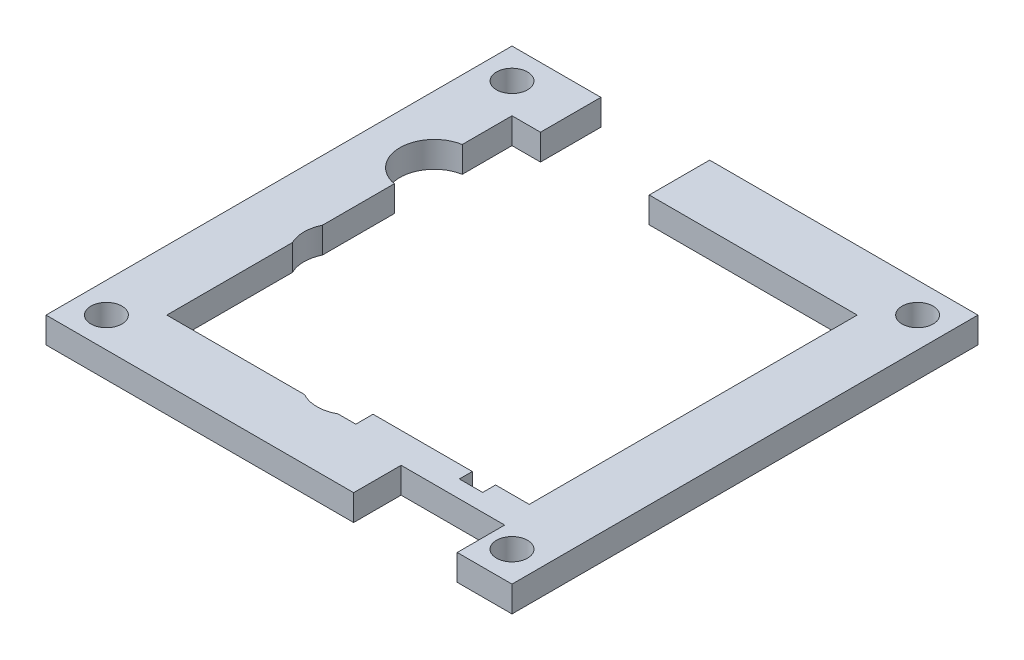
ISO-10303-21;
HEADER;
FILE_DESCRIPTION(('STEP AP214'),'2;1');
FILE_NAME('part.step','',(''),(''),'','','');
FILE_SCHEMA(('AUTOMOTIVE_DESIGN { 1 0 10303 214 1 1 1 1 }'));
ENDSEC;
DATA;
#1=APPLICATION_CONTEXT('core data for automotive mechanical design processes');
#2=APPLICATION_PROTOCOL_DEFINITION('international standard','automotive_design',2000,#1);
#3=PRODUCT_CONTEXT('',#1,'mechanical');
#4=PRODUCT('Part','Part','',(#3));
#5=PRODUCT_RELATED_PRODUCT_CATEGORY('part','',(#4));
#6=PRODUCT_DEFINITION_FORMATION('','',#4);
#7=PRODUCT_DEFINITION_CONTEXT('part definition',#1,'design');
#8=PRODUCT_DEFINITION('design','',#6,#7);
#9=PRODUCT_DEFINITION_SHAPE('','',#8);
#10=(LENGTH_UNIT() NAMED_UNIT(*) SI_UNIT(.MILLI.,.METRE.));
#11=(NAMED_UNIT(*) PLANE_ANGLE_UNIT() SI_UNIT($,.RADIAN.));
#12=(NAMED_UNIT(*) SI_UNIT($,.STERADIAN.) SOLID_ANGLE_UNIT());
#13=UNCERTAINTY_MEASURE_WITH_UNIT(LENGTH_MEASURE(1.E-05),#10,'distance_accuracy_value','');
#14=(GEOMETRIC_REPRESENTATION_CONTEXT(3) GLOBAL_UNCERTAINTY_ASSIGNED_CONTEXT((#13)) GLOBAL_UNIT_ASSIGNED_CONTEXT((#10,
#11,#12)) REPRESENTATION_CONTEXT('',''));
#15=CARTESIAN_POINT('',(0.,0.,0.));
#16=DIRECTION('',(0.,0.,1.));
#17=DIRECTION('',(1.,0.,0.));
#18=AXIS2_PLACEMENT_3D('',#15,#16,#17);
#19=CARTESIAN_POINT('',(20.,3.,0.));
#20=DIRECTION('',(-1.,0.,0.));
#21=DIRECTION('',(0.,0.,1.));
#22=AXIS2_PLACEMENT_3D('',#19,#20,#21);
#23=PLANE('',#22);
#24=DIRECTION('',(0.,0.,-1.));
#25=VECTOR('',#24,1.);
#26=CARTESIAN_POINT('',(20.,0.,0.));
#27=LINE('',#26,#25);
#28=CARTESIAN_POINT('',(20.,0.,18.));
#29=VERTEX_POINT('',#28);
#30=CARTESIAN_POINT('',(20.,0.,-20.));
#31=VERTEX_POINT('',#30);
#32=EDGE_CURVE('E261',#29,#31,#27,.T.);
#33=ORIENTED_EDGE('',*,*,#32,.F.);
#34=DIRECTION('',(0.,-1.,0.));
#35=VECTOR('',#34,1.);
#36=CARTESIAN_POINT('',(20.,3.,18.));
#37=LINE('',#36,#35);
#38=CARTESIAN_POINT('',(20.,3.,18.));
#39=VERTEX_POINT('',#38);
#40=EDGE_CURVE('E11',#39,#29,#37,.T.);
#41=ORIENTED_EDGE('',*,*,#40,.F.);
#42=DIRECTION('',(0.,0.,-1.));
#43=VECTOR('',#42,1.);
#44=CARTESIAN_POINT('',(20.,3.,0.));
#45=LINE('',#44,#43);
#46=CARTESIAN_POINT('',(20.,3.,-20.));
#47=VERTEX_POINT('',#46);
#48=EDGE_CURVE('E339',#39,#47,#45,.T.);
#49=ORIENTED_EDGE('',*,*,#48,.T.);
#50=DIRECTION('',(0.,-1.,0.));
#51=VECTOR('',#50,1.);
#52=CARTESIAN_POINT('',(20.,3.,-20.));
#53=LINE('',#52,#51);
#54=EDGE_CURVE('E145',#47,#31,#53,.T.);
#55=ORIENTED_EDGE('',*,*,#54,.T.);
#56=EDGE_LOOP('',(#33,#41,#49,#55));
#57=FACE_BOUND('',#56,.T.);
#58=ADVANCED_FACE('F35',(#57),#23,.T.);
#59=CARTESIAN_POINT('',(0.,3.,18.));
#60=DIRECTION('',(0.,0.,-1.));
#61=DIRECTION('',(-1.,0.,0.));
#62=AXIS2_PLACEMENT_3D('',#59,#60,#61);
#63=PLANE('',#62);
#64=DIRECTION('',(1.,0.,0.));
#65=VECTOR('',#64,1.);
#66=CARTESIAN_POINT('',(0.,0.,18.));
#67=LINE('',#66,#65);
#68=CARTESIAN_POINT('',(16.1,0.,18.));
#69=VERTEX_POINT('',#68);
#70=EDGE_CURVE('E264',#69,#29,#67,.T.);
#71=ORIENTED_EDGE('',*,*,#70,.F.);
#72=DIRECTION('',(0.,-1.,0.));
#73=VECTOR('',#72,1.);
#74=CARTESIAN_POINT('',(16.1,3.,18.));
#75=LINE('',#74,#73);
#76=CARTESIAN_POINT('',(16.1,3.,18.));
#77=VERTEX_POINT('',#76);
#78=EDGE_CURVE('E43',#77,#69,#75,.T.);
#79=ORIENTED_EDGE('',*,*,#78,.F.);
#80=DIRECTION('',(1.,0.,0.));
#81=VECTOR('',#80,1.);
#82=CARTESIAN_POINT('',(0.,3.,18.));
#83=LINE('',#82,#81);
#84=EDGE_CURVE('E408',#77,#39,#83,.T.);
#85=ORIENTED_EDGE('',*,*,#84,.T.);
#86=ORIENTED_EDGE('',*,*,#40,.T.);
#87=EDGE_LOOP('',(#71,#79,#85,#86));
#88=FACE_BOUND('',#87,.T.);
#89=ADVANCED_FACE('F407',(#88),#63,.T.);
#90=CARTESIAN_POINT('',(16.1,3.,0.));
#91=DIRECTION('',(1.,0.,0.));
#92=DIRECTION('',(0.,0.,-1.));
#93=AXIS2_PLACEMENT_3D('',#90,#91,#92);
#94=PLANE('',#93);
#95=DIRECTION('',(0.,0.,1.));
#96=VECTOR('',#95,1.);
#97=CARTESIAN_POINT('',(16.1,0.,0.));
#98=LINE('',#97,#96);
#99=CARTESIAN_POINT('',(16.1,0.,19.5));
#100=VERTEX_POINT('',#99);
#101=EDGE_CURVE('E267',#69,#100,#98,.T.);
#102=ORIENTED_EDGE('',*,*,#101,.T.);
#103=DIRECTION('',(0.,-1.,0.));
#104=VECTOR('',#103,1.);
#105=CARTESIAN_POINT('',(16.1,3.,19.5));
#106=LINE('',#105,#104);
#107=CARTESIAN_POINT('',(16.1,3.,19.5));
#108=VERTEX_POINT('',#107);
#109=EDGE_CURVE('E392',#108,#100,#106,.T.);
#110=ORIENTED_EDGE('',*,*,#109,.F.);
#111=DIRECTION('',(0.,0.,1.));
#112=VECTOR('',#111,1.);
#113=CARTESIAN_POINT('',(16.1,3.,0.));
#114=LINE('',#113,#112);
#115=EDGE_CURVE('E398',#77,#108,#114,.T.);
#116=ORIENTED_EDGE('',*,*,#115,.F.);
#117=ORIENTED_EDGE('',*,*,#78,.T.);
#118=EDGE_LOOP('',(#102,#110,#116,#117));
#119=FACE_BOUND('',#118,.T.);
#120=ADVANCED_FACE('F396',(#119),#94,.F.);
#121=CARTESIAN_POINT('',(0.,3.,19.5));
#122=DIRECTION('',(0.,0.,-1.));
#123=DIRECTION('',(-1.,0.,0.));
#124=AXIS2_PLACEMENT_3D('',#121,#122,#123);
#125=PLANE('',#124);
#126=DIRECTION('',(1.,0.,0.));
#127=VECTOR('',#126,1.);
#128=CARTESIAN_POINT('',(0.,0.,19.5));
#129=LINE('',#128,#127);
#130=CARTESIAN_POINT('',(13.4,0.,19.5));
#131=VERTEX_POINT('',#130);
#132=EDGE_CURVE('E270',#131,#100,#129,.T.);
#133=ORIENTED_EDGE('',*,*,#132,.F.);
#134=DIRECTION('',(0.,-1.,0.));
#135=VECTOR('',#134,1.);
#136=CARTESIAN_POINT('',(13.4,3.,19.5));
#137=LINE('',#136,#135);
#138=CARTESIAN_POINT('',(13.4,3.,19.5));
#139=VERTEX_POINT('',#138);
#140=EDGE_CURVE('E390',#139,#131,#137,.T.);
#141=ORIENTED_EDGE('',*,*,#140,.F.);
#142=DIRECTION('',(1.,0.,0.));
#143=VECTOR('',#142,1.);
#144=CARTESIAN_POINT('',(0.,3.,19.5));
#145=LINE('',#144,#143);
#146=EDGE_CURVE('E414',#139,#108,#145,.T.);
#147=ORIENTED_EDGE('',*,*,#146,.T.);
#148=ORIENTED_EDGE('',*,*,#109,.T.);
#149=EDGE_LOOP('',(#133,#141,#147,#148));
#150=FACE_BOUND('',#149,.T.);
#151=ADVANCED_FACE('F558',(#150),#125,.T.);
#152=CARTESIAN_POINT('',(13.4,3.,0.));
#153=DIRECTION('',(1.,0.,0.));
#154=DIRECTION('',(0.,0.,-1.));
#155=AXIS2_PLACEMENT_3D('',#152,#153,#154);
#156=PLANE('',#155);
#157=DIRECTION('',(0.,0.,1.));
#158=VECTOR('',#157,1.);
#159=CARTESIAN_POINT('',(13.4,0.,0.));
#160=LINE('',#159,#158);
#161=CARTESIAN_POINT('',(13.4,0.,18.));
#162=VERTEX_POINT('',#161);
#163=EDGE_CURVE('E273',#162,#131,#160,.T.);
#164=ORIENTED_EDGE('',*,*,#163,.F.);
#165=DIRECTION('',(0.,-1.,0.));
#166=VECTOR('',#165,1.);
#167=CARTESIAN_POINT('',(13.4,3.,18.));
#168=LINE('',#167,#166);
#169=CARTESIAN_POINT('',(13.4,3.,18.));
#170=VERTEX_POINT('',#169);
#171=EDGE_CURVE('E388',#170,#162,#168,.T.);
#172=ORIENTED_EDGE('',*,*,#171,.F.);
#173=DIRECTION('',(0.,0.,1.));
#174=VECTOR('',#173,1.);
#175=CARTESIAN_POINT('',(13.4,3.,0.));
#176=LINE('',#175,#174);
#177=EDGE_CURVE('E417',#170,#139,#176,.T.);
#178=ORIENTED_EDGE('',*,*,#177,.T.);
#179=ORIENTED_EDGE('',*,*,#140,.T.);
#180=EDGE_LOOP('',(#164,#172,#178,#179));
#181=FACE_BOUND('',#180,.T.);
#182=ADVANCED_FACE('F555',(#181),#156,.T.);
#183=CARTESIAN_POINT('',(0.,3.,18.));
#184=DIRECTION('',(0.,0.,-1.));
#185=DIRECTION('',(-1.,0.,0.));
#186=AXIS2_PLACEMENT_3D('',#183,#184,#185);
#187=PLANE('',#186);
#188=DIRECTION('',(1.,0.,0.));
#189=VECTOR('',#188,1.);
#190=CARTESIAN_POINT('',(0.,0.,18.));
#191=LINE('',#190,#189);
#192=CARTESIAN_POINT('',(1.9,0.,18.));
#193=VERTEX_POINT('',#192);
#194=EDGE_CURVE('E276',#193,#162,#191,.T.);
#195=ORIENTED_EDGE('',*,*,#194,.F.);
#196=DIRECTION('',(0.,-1.,0.));
#197=VECTOR('',#196,1.);
#198=CARTESIAN_POINT('',(1.9,3.,18.));
#199=LINE('',#198,#197);
#200=CARTESIAN_POINT('',(1.9,3.,18.));
#201=VERTEX_POINT('',#200);
#202=EDGE_CURVE('E386',#201,#193,#199,.T.);
#203=ORIENTED_EDGE('',*,*,#202,.F.);
#204=DIRECTION('',(1.,0.,0.));
#205=VECTOR('',#204,1.);
#206=CARTESIAN_POINT('',(0.,3.,18.));
#207=LINE('',#206,#205);
#208=EDGE_CURVE('E420',#201,#170,#207,.T.);
#209=ORIENTED_EDGE('',*,*,#208,.T.);
#210=ORIENTED_EDGE('',*,*,#171,.T.);
#211=EDGE_LOOP('',(#195,#203,#209,#210));
#212=FACE_BOUND('',#211,.T.);
#213=ADVANCED_FACE('F551',(#212),#187,.T.);
#214=CARTESIAN_POINT('',(1.9,3.,0.));
#215=DIRECTION('',(-1.,0.,0.));
#216=DIRECTION('',(0.,0.,1.));
#217=AXIS2_PLACEMENT_3D('',#214,#215,#216);
#218=PLANE('',#217);
#219=DIRECTION('',(0.,0.,-1.));
#220=VECTOR('',#219,1.);
#221=CARTESIAN_POINT('',(1.9,0.,0.));
#222=LINE('',#221,#220);
#223=CARTESIAN_POINT('',(1.9,0.,20.));
#224=VERTEX_POINT('',#223);
#225=EDGE_CURVE('E279',#224,#193,#222,.T.);
#226=ORIENTED_EDGE('',*,*,#225,.F.);
#227=DIRECTION('',(0.,-1.,0.));
#228=VECTOR('',#227,1.);
#229=CARTESIAN_POINT('',(1.9,3.,20.));
#230=LINE('',#229,#228);
#231=CARTESIAN_POINT('',(1.9,3.,20.));
#232=VERTEX_POINT('',#231);
#233=EDGE_CURVE('E384',#232,#224,#230,.T.);
#234=ORIENTED_EDGE('',*,*,#233,.F.);
#235=DIRECTION('',(0.,0.,-1.));
#236=VECTOR('',#235,1.);
#237=CARTESIAN_POINT('',(1.9,3.,0.));
#238=LINE('',#237,#236);
#239=EDGE_CURVE('E423',#232,#201,#238,.T.);
#240=ORIENTED_EDGE('',*,*,#239,.T.);
#241=ORIENTED_EDGE('',*,*,#202,.T.);
#242=EDGE_LOOP('',(#226,#234,#240,#241));
#243=FACE_BOUND('',#242,.T.);
#244=ADVANCED_FACE('F547',(#243),#218,.T.);
#245=CARTESIAN_POINT('',(0.,3.,20.));
#246=DIRECTION('',(0.,0.,-1.));
#247=DIRECTION('',(-1.,0.,0.));
#248=AXIS2_PLACEMENT_3D('',#245,#246,#247);
#249=PLANE('',#248);
#250=DIRECTION('',(1.,0.,0.));
#251=VECTOR('',#250,1.);
#252=CARTESIAN_POINT('',(0.,0.,20.));
#253=LINE('',#252,#251);
#254=CARTESIAN_POINT('',(-0.163508326896289,0.,20.));
#255=VERTEX_POINT('',#254);
#256=EDGE_CURVE('E282',#255,#224,#253,.T.);
#257=ORIENTED_EDGE('',*,*,#256,.F.);
#258=DIRECTION('',(0.,-1.,0.));
#259=VECTOR('',#258,1.);
#260=CARTESIAN_POINT('',(-0.163508326896289,3.,20.));
#261=LINE('',#260,#259);
#262=CARTESIAN_POINT('',(-0.163508326896289,3.,20.));
#263=VERTEX_POINT('',#262);
#264=EDGE_CURVE('E382',#263,#255,#261,.T.);
#265=ORIENTED_EDGE('',*,*,#264,.F.);
#266=DIRECTION('',(1.,0.,0.));
#267=VECTOR('',#266,1.);
#268=CARTESIAN_POINT('',(0.,3.,20.));
#269=LINE('',#268,#267);
#270=EDGE_CURVE('E426',#263,#232,#269,.T.);
#271=ORIENTED_EDGE('',*,*,#270,.T.);
#272=ORIENTED_EDGE('',*,*,#233,.T.);
#273=EDGE_LOOP('',(#257,#265,#271,#272));
#274=FACE_BOUND('',#273,.T.);
#275=ADVANCED_FACE('F543',(#274),#249,.T.);
#276=CARTESIAN_POINT('',(-2.1,3.,16.5));
#277=DIRECTION('',(0.,-1.,0.));
#278=DIRECTION('',(0.,0.,-1.));
#279=AXIS2_PLACEMENT_3D('',#276,#277,#278);
#280=CYLINDRICAL_SURFACE('',#279,4.);
#281=CARTESIAN_POINT('',(-2.1,0.,16.5));
#282=DIRECTION('',(0.,1.,0.));
#283=DIRECTION('',(0.,0.,1.));
#284=AXIS2_PLACEMENT_3D('',#281,#282,#283);
#285=CIRCLE('',#284,4.);
#286=CARTESIAN_POINT('',(-4.03649167310371,0.,20.));
#287=VERTEX_POINT('',#286);
#288=EDGE_CURVE('E285',#287,#255,#285,.T.);
#289=ORIENTED_EDGE('',*,*,#288,.F.);
#290=DIRECTION('',(0.,-1.,0.));
#291=VECTOR('',#290,1.);
#292=CARTESIAN_POINT('',(-4.03649167310371,3.,20.));
#293=LINE('',#292,#291);
#294=CARTESIAN_POINT('',(-4.03649167310371,3.,20.));
#295=VERTEX_POINT('',#294);
#296=EDGE_CURVE('E380',#295,#287,#293,.T.);
#297=ORIENTED_EDGE('',*,*,#296,.F.);
#298=CARTESIAN_POINT('',(-2.1,3.,16.5));
#299=DIRECTION('',(0.,1.,0.));
#300=DIRECTION('',(0.,0.,1.));
#301=AXIS2_PLACEMENT_3D('',#298,#299,#300);
#302=CIRCLE('',#301,4.);
#303=EDGE_CURVE('E429',#295,#263,#302,.T.);
#304=ORIENTED_EDGE('',*,*,#303,.T.);
#305=ORIENTED_EDGE('',*,*,#264,.T.);
#306=EDGE_LOOP('',(#289,#297,#304,#305));
#307=FACE_BOUND('',#306,.T.);
#308=ADVANCED_FACE('F539',(#307),#280,.F.);
#309=CARTESIAN_POINT('',(-20.,0.,20.));
#310=VERTEX_POINT('',#309);
#311=EDGE_CURVE('E286',#310,#287,#253,.T.);
#312=ORIENTED_EDGE('',*,*,#311,.F.);
#313=DIRECTION('',(0.,-1.,0.));
#314=VECTOR('',#313,1.);
#315=CARTESIAN_POINT('',(-20.,3.,20.));
#316=LINE('',#315,#314);
#317=CARTESIAN_POINT('',(-20.,3.,20.));
#318=VERTEX_POINT('',#317);
#319=EDGE_CURVE('E378',#318,#310,#316,.T.);
#320=ORIENTED_EDGE('',*,*,#319,.F.);
#321=EDGE_CURVE('E430',#318,#295,#269,.T.);
#322=ORIENTED_EDGE('',*,*,#321,.T.);
#323=ORIENTED_EDGE('',*,*,#296,.T.);
#324=EDGE_LOOP('',(#312,#320,#322,#323));
#325=FACE_BOUND('',#324,.T.);
#326=ADVANCED_FACE('F534',(#325),#249,.T.);
#327=CARTESIAN_POINT('',(-20.,3.,0.));
#328=DIRECTION('',(1.,0.,0.));
#329=DIRECTION('',(0.,0.,-1.));
#330=AXIS2_PLACEMENT_3D('',#327,#328,#329);
#331=PLANE('',#330);
#332=DIRECTION('',(0.,0.,1.));
#333=VECTOR('',#332,1.);
#334=CARTESIAN_POINT('',(-20.,0.,0.));
#335=LINE('',#334,#333);
#336=CARTESIAN_POINT('',(-20.,0.,5.44355957741626));
#337=VERTEX_POINT('',#336);
#338=EDGE_CURVE('E289',#337,#310,#335,.T.);
#339=ORIENTED_EDGE('',*,*,#338,.F.);
#340=DIRECTION('',(0.,-1.,0.));
#341=VECTOR('',#340,1.);
#342=CARTESIAN_POINT('',(-20.,3.,5.44355957741626));
#343=LINE('',#342,#341);
#344=CARTESIAN_POINT('',(-20.,3.,5.44355957741626));
#345=VERTEX_POINT('',#344);
#346=EDGE_CURVE('E376',#345,#337,#343,.T.);
#347=ORIENTED_EDGE('',*,*,#346,.F.);
#348=DIRECTION('',(0.,0.,1.));
#349=VECTOR('',#348,1.);
#350=CARTESIAN_POINT('',(-20.,3.,0.));
#351=LINE('',#350,#349);
#352=EDGE_CURVE('E433',#345,#318,#351,.T.);
#353=ORIENTED_EDGE('',*,*,#352,.T.);
#354=ORIENTED_EDGE('',*,*,#319,.T.);
#355=EDGE_LOOP('',(#339,#347,#353,#354));
#356=FACE_BOUND('',#355,.T.);
#357=ADVANCED_FACE('F529',(#356),#331,.T.);
#358=CARTESIAN_POINT('',(-16.4,3.,3.7));
#359=DIRECTION('',(0.,-1.,0.));
#360=DIRECTION('',(0.,0.,-1.));
#361=AXIS2_PLACEMENT_3D('',#358,#359,#360);
#362=CYLINDRICAL_SURFACE('',#361,4.);
#363=CARTESIAN_POINT('',(-16.4,0.,3.7));
#364=DIRECTION('',(0.,1.,0.));
#365=DIRECTION('',(0.,0.,1.));
#366=AXIS2_PLACEMENT_3D('',#363,#364,#365);
#367=CIRCLE('',#366,4.);
#368=CARTESIAN_POINT('',(-20.,0.,1.95644042258373));
#369=VERTEX_POINT('',#368);
#370=EDGE_CURVE('E292',#369,#337,#367,.T.);
#371=ORIENTED_EDGE('',*,*,#370,.F.);
#372=DIRECTION('',(0.,-1.,0.));
#373=VECTOR('',#372,1.);
#374=CARTESIAN_POINT('',(-20.,3.,1.95644042258373));
#375=LINE('',#374,#373);
#376=CARTESIAN_POINT('',(-20.,3.,1.95644042258373));
#377=VERTEX_POINT('',#376);
#378=EDGE_CURVE('E374',#377,#369,#375,.T.);
#379=ORIENTED_EDGE('',*,*,#378,.F.);
#380=CARTESIAN_POINT('',(-16.4,3.,3.7));
#381=DIRECTION('',(0.,1.,0.));
#382=DIRECTION('',(0.,0.,1.));
#383=AXIS2_PLACEMENT_3D('',#380,#381,#382);
#384=CIRCLE('',#383,4.);
#385=EDGE_CURVE('E436',#377,#345,#384,.T.);
#386=ORIENTED_EDGE('',*,*,#385,.T.);
#387=ORIENTED_EDGE('',*,*,#346,.T.);
#388=EDGE_LOOP('',(#371,#379,#386,#387));
#389=FACE_BOUND('',#388,.T.);
#390=ADVANCED_FACE('F525',(#389),#362,.F.);
#391=CARTESIAN_POINT('',(-20.,0.,-6.36172626649696));
#392=VERTEX_POINT('',#391);
#393=EDGE_CURVE('E294',#392,#369,#335,.T.);
#394=ORIENTED_EDGE('',*,*,#393,.F.);
#395=DIRECTION('',(0.,-1.,0.));
#396=VECTOR('',#395,1.);
#397=CARTESIAN_POINT('',(-20.,3.,-6.36172626649696));
#398=LINE('',#397,#396);
#399=CARTESIAN_POINT('',(-20.,3.,-6.36172626649696));
#400=VERTEX_POINT('',#399);
#401=EDGE_CURVE('E372',#400,#392,#398,.T.);
#402=ORIENTED_EDGE('',*,*,#401,.F.);
#403=EDGE_CURVE('E438',#400,#377,#351,.T.);
#404=ORIENTED_EDGE('',*,*,#403,.T.);
#405=ORIENTED_EDGE('',*,*,#378,.T.);
#406=EDGE_LOOP('',(#394,#402,#404,#405));
#407=FACE_BOUND('',#406,.T.);
#408=ADVANCED_FACE('F520',(#407),#331,.T.);
#409=CARTESIAN_POINT('',(-19.3,3.,-10.3));
#410=DIRECTION('',(0.,-1.,0.));
#411=DIRECTION('',(0.,0.,-1.));
#412=AXIS2_PLACEMENT_3D('',#409,#410,#411);
#413=CYLINDRICAL_SURFACE('',#412,4.);
#414=CARTESIAN_POINT('',(-19.3,0.,-10.3));
#415=DIRECTION('',(0.,1.,0.));
#416=DIRECTION('',(0.,0.,1.));
#417=AXIS2_PLACEMENT_3D('',#414,#415,#416);
#418=CIRCLE('',#417,4.);
#419=CARTESIAN_POINT('',(-20.,0.,-14.238273733503));
#420=VERTEX_POINT('',#419);
#421=EDGE_CURVE('E297',#420,#392,#418,.T.);
#422=ORIENTED_EDGE('',*,*,#421,.F.);
#423=DIRECTION('',(0.,-1.,0.));
#424=VECTOR('',#423,1.);
#425=CARTESIAN_POINT('',(-20.,3.,-14.238273733503));
#426=LINE('',#425,#424);
#427=CARTESIAN_POINT('',(-20.,3.,-14.238273733503));
#428=VERTEX_POINT('',#427);
#429=EDGE_CURVE('E370',#428,#420,#426,.T.);
#430=ORIENTED_EDGE('',*,*,#429,.F.);
#431=CARTESIAN_POINT('',(-19.3,3.,-10.3));
#432=DIRECTION('',(0.,1.,0.));
#433=DIRECTION('',(0.,0.,1.));
#434=AXIS2_PLACEMENT_3D('',#431,#432,#433);
#435=CIRCLE('',#434,4.);
#436=EDGE_CURVE('E441',#428,#400,#435,.T.);
#437=ORIENTED_EDGE('',*,*,#436,.T.);
#438=ORIENTED_EDGE('',*,*,#401,.T.);
#439=EDGE_LOOP('',(#422,#430,#437,#438));
#440=FACE_BOUND('',#439,.T.);
#441=ADVANCED_FACE('F561',(#440),#413,.F.);
#442=CARTESIAN_POINT('',(-20.,0.,-20.));
#443=VERTEX_POINT('',#442);
#444=EDGE_CURVE('E293',#443,#420,#335,.T.);
#445=ORIENTED_EDGE('',*,*,#444,.F.);
#446=DIRECTION('',(0.,-1.,0.));
#447=VECTOR('',#446,1.);
#448=CARTESIAN_POINT('',(-20.,3.,-20.));
#449=LINE('',#448,#447);
#450=CARTESIAN_POINT('',(-20.,3.,-20.));
#451=VERTEX_POINT('',#450);
#452=EDGE_CURVE('E368',#451,#443,#449,.T.);
#453=ORIENTED_EDGE('',*,*,#452,.F.);
#454=EDGE_CURVE('E437',#451,#428,#351,.T.);
#455=ORIENTED_EDGE('',*,*,#454,.T.);
#456=ORIENTED_EDGE('',*,*,#429,.T.);
#457=EDGE_LOOP('',(#445,#453,#455,#456));
#458=FACE_BOUND('',#457,.T.);
#459=ADVANCED_FACE('F514',(#458),#331,.T.);
#460=CARTESIAN_POINT('',(0.,3.,-20.));
#461=DIRECTION('',(0.,0.,-1.));
#462=DIRECTION('',(-1.,0.,0.));
#463=AXIS2_PLACEMENT_3D('',#460,#461,#462);
#464=PLANE('',#463);
#465=DIRECTION('',(1.,0.,0.));
#466=VECTOR('',#465,1.);
#467=CARTESIAN_POINT('',(0.,0.,-20.));
#468=LINE('',#467,#466);
#469=CARTESIAN_POINT('',(-16.7,0.,-20.));
#470=VERTEX_POINT('',#469);
#471=EDGE_CURVE('E300',#443,#470,#468,.T.);
#472=ORIENTED_EDGE('',*,*,#471,.T.);
#473=DIRECTION('',(0.,-1.,0.));
#474=VECTOR('',#473,1.);
#475=CARTESIAN_POINT('',(-16.7,3.,-20.));
#476=LINE('',#475,#474);
#477=CARTESIAN_POINT('',(-16.7,3.,-20.));
#478=VERTEX_POINT('',#477);
#479=EDGE_CURVE('E365',#478,#470,#476,.T.);
#480=ORIENTED_EDGE('',*,*,#479,.F.);
#481=DIRECTION('',(1.,0.,0.));
#482=VECTOR('',#481,1.);
#483=CARTESIAN_POINT('',(0.,3.,-20.));
#484=LINE('',#483,#482);
#485=EDGE_CURVE('E444',#451,#478,#484,.T.);
#486=ORIENTED_EDGE('',*,*,#485,.F.);
#487=ORIENTED_EDGE('',*,*,#452,.T.);
#488=EDGE_LOOP('',(#472,#480,#486,#487));
#489=FACE_BOUND('',#488,.T.);
#490=ADVANCED_FACE('F510',(#489),#464,.F.);
#491=CARTESIAN_POINT('',(-16.7,3.,0.));
#492=DIRECTION('',(-1.,0.,0.));
#493=DIRECTION('',(0.,0.,1.));
#494=AXIS2_PLACEMENT_3D('',#491,#492,#493);
#495=PLANE('',#494);
#496=DIRECTION('',(0.,0.,-1.));
#497=VECTOR('',#496,1.);
#498=CARTESIAN_POINT('',(-16.7,0.,0.));
#499=LINE('',#498,#497);
#500=CARTESIAN_POINT('',(-16.7,0.,-27.));
#501=VERTEX_POINT('',#500);
#502=EDGE_CURVE('E302',#470,#501,#499,.T.);
#503=ORIENTED_EDGE('',*,*,#502,.T.);
#504=DIRECTION('',(0.,-1.,0.));
#505=VECTOR('',#504,1.);
#506=CARTESIAN_POINT('',(-16.7,3.,-27.));
#507=LINE('',#506,#505);
#508=CARTESIAN_POINT('',(-16.7,3.,-27.));
#509=VERTEX_POINT('',#508);
#510=EDGE_CURVE('E362',#509,#501,#507,.T.);
#511=ORIENTED_EDGE('',*,*,#510,.F.);
#512=DIRECTION('',(0.,0.,-1.));
#513=VECTOR('',#512,1.);
#514=CARTESIAN_POINT('',(-16.7,3.,0.));
#515=LINE('',#514,#513);
#516=EDGE_CURVE('E446',#478,#509,#515,.T.);
#517=ORIENTED_EDGE('',*,*,#516,.F.);
#518=ORIENTED_EDGE('',*,*,#479,.T.);
#519=EDGE_LOOP('',(#503,#511,#517,#518));
#520=FACE_BOUND('',#519,.T.);
#521=ADVANCED_FACE('F505',(#520),#495,.F.);
#522=CARTESIAN_POINT('',(0.,3.,-27.));
#523=DIRECTION('',(0.,0.,1.));
#524=DIRECTION('',(1.,0.,0.));
#525=AXIS2_PLACEMENT_3D('',#522,#523,#524);
#526=PLANE('',#525);
#527=DIRECTION('',(-1.,0.,0.));
#528=VECTOR('',#527,1.);
#529=CARTESIAN_POINT('',(0.,0.,-27.));
#530=LINE('',#529,#528);
#531=CARTESIAN_POINT('',(-27.,0.,-27.));
#532=VERTEX_POINT('',#531);
#533=EDGE_CURVE('E304',#501,#532,#530,.T.);
#534=ORIENTED_EDGE('',*,*,#533,.T.);
#535=DIRECTION('',(0.,-1.,0.));
#536=VECTOR('',#535,1.);
#537=CARTESIAN_POINT('',(-27.,3.,-27.));
#538=LINE('',#537,#536);
#539=CARTESIAN_POINT('',(-27.,3.,-27.));
#540=VERTEX_POINT('',#539);
#541=EDGE_CURVE('E359',#540,#532,#538,.T.);
#542=ORIENTED_EDGE('',*,*,#541,.F.);
#543=DIRECTION('',(-1.,0.,0.));
#544=VECTOR('',#543,1.);
#545=CARTESIAN_POINT('',(0.,3.,-27.));
#546=LINE('',#545,#544);
#547=EDGE_CURVE('E448',#509,#540,#546,.T.);
#548=ORIENTED_EDGE('',*,*,#547,.F.);
#549=ORIENTED_EDGE('',*,*,#510,.T.);
#550=EDGE_LOOP('',(#534,#542,#548,#549));
#551=FACE_BOUND('',#550,.T.);
#552=ADVANCED_FACE('F498',(#551),#526,.F.);
#553=CARTESIAN_POINT('',(-27.,3.,0.));
#554=DIRECTION('',(1.,0.,0.));
#555=DIRECTION('',(0.,0.,-1.));
#556=AXIS2_PLACEMENT_3D('',#553,#554,#555);
#557=PLANE('',#556);
#558=DIRECTION('',(0.,0.,1.));
#559=VECTOR('',#558,1.);
#560=CARTESIAN_POINT('',(-27.,0.,0.));
#561=LINE('',#560,#559);
#562=CARTESIAN_POINT('',(-27.,0.,27.));
#563=VERTEX_POINT('',#562);
#564=EDGE_CURVE('E306',#532,#563,#561,.T.);
#565=ORIENTED_EDGE('',*,*,#564,.T.);
#566=DIRECTION('',(0.,-1.,0.));
#567=VECTOR('',#566,1.);
#568=CARTESIAN_POINT('',(-27.,3.,27.));
#569=LINE('',#568,#567);
#570=CARTESIAN_POINT('',(-27.,3.,27.));
#571=VERTEX_POINT('',#570);
#572=EDGE_CURVE('E356',#571,#563,#569,.T.);
#573=ORIENTED_EDGE('',*,*,#572,.F.);
#574=DIRECTION('',(0.,0.,1.));
#575=VECTOR('',#574,1.);
#576=CARTESIAN_POINT('',(-27.,3.,0.));
#577=LINE('',#576,#575);
#578=EDGE_CURVE('E450',#540,#571,#577,.T.);
#579=ORIENTED_EDGE('',*,*,#578,.F.);
#580=ORIENTED_EDGE('',*,*,#541,.T.);
#581=EDGE_LOOP('',(#565,#573,#579,#580));
#582=FACE_BOUND('',#581,.T.);
#583=ADVANCED_FACE('F494',(#582),#557,.F.);
#584=CARTESIAN_POINT('',(0.,3.,27.));
#585=DIRECTION('',(0.,0.,-1.));
#586=DIRECTION('',(-1.,0.,0.));
#587=AXIS2_PLACEMENT_3D('',#584,#585,#586);
#588=PLANE('',#587);
#589=DIRECTION('',(1.,0.,0.));
#590=VECTOR('',#589,1.);
#591=CARTESIAN_POINT('',(0.,0.,27.));
#592=LINE('',#591,#590);
#593=CARTESIAN_POINT('',(8.65,0.,27.));
#594=VERTEX_POINT('',#593);
#595=EDGE_CURVE('E308',#563,#594,#592,.T.);
#596=ORIENTED_EDGE('',*,*,#595,.T.);
#597=DIRECTION('',(0.,-1.,0.));
#598=VECTOR('',#597,1.);
#599=CARTESIAN_POINT('',(8.65,3.,27.));
#600=LINE('',#599,#598);
#601=CARTESIAN_POINT('',(8.65,3.,27.));
#602=VERTEX_POINT('',#601);
#603=EDGE_CURVE('E354',#602,#594,#600,.T.);
#604=ORIENTED_EDGE('',*,*,#603,.F.);
#605=DIRECTION('',(1.,0.,0.));
#606=VECTOR('',#605,1.);
#607=CARTESIAN_POINT('',(0.,3.,27.));
#608=LINE('',#607,#606);
#609=EDGE_CURVE('E452',#571,#602,#608,.T.);
#610=ORIENTED_EDGE('',*,*,#609,.F.);
#611=ORIENTED_EDGE('',*,*,#572,.T.);
#612=EDGE_LOOP('',(#596,#604,#610,#611));
#613=FACE_BOUND('',#612,.T.);
#614=ADVANCED_FACE('F489',(#613),#588,.F.);
#615=CARTESIAN_POINT('',(8.65,3.,0.));
#616=DIRECTION('',(1.,0.,0.));
#617=DIRECTION('',(0.,0.,-1.));
#618=AXIS2_PLACEMENT_3D('',#615,#616,#617);
#619=PLANE('',#618);
#620=DIRECTION('',(0.,0.,1.));
#621=VECTOR('',#620,1.);
#622=CARTESIAN_POINT('',(8.65,0.,0.));
#623=LINE('',#622,#621);
#624=CARTESIAN_POINT('',(8.65,0.,21.5));
#625=VERTEX_POINT('',#624);
#626=EDGE_CURVE('E311',#625,#594,#623,.T.);
#627=ORIENTED_EDGE('',*,*,#626,.F.);
#628=DIRECTION('',(0.,-1.,0.));
#629=VECTOR('',#628,1.);
#630=CARTESIAN_POINT('',(8.65,3.,21.5));
#631=LINE('',#630,#629);
#632=CARTESIAN_POINT('',(8.65,3.,21.5));
#633=VERTEX_POINT('',#632);
#634=EDGE_CURVE('E352',#633,#625,#631,.T.);
#635=ORIENTED_EDGE('',*,*,#634,.F.);
#636=DIRECTION('',(0.,0.,1.));
#637=VECTOR('',#636,1.);
#638=CARTESIAN_POINT('',(8.65,3.,0.));
#639=LINE('',#638,#637);
#640=EDGE_CURVE('E454',#633,#602,#639,.T.);
#641=ORIENTED_EDGE('',*,*,#640,.T.);
#642=ORIENTED_EDGE('',*,*,#603,.T.);
#643=EDGE_LOOP('',(#627,#635,#641,#642));
#644=FACE_BOUND('',#643,.T.);
#645=ADVANCED_FACE('F483',(#644),#619,.T.);
#646=CARTESIAN_POINT('',(0.,3.,21.5));
#647=DIRECTION('',(0.,0.,-1.));
#648=DIRECTION('',(-1.,0.,0.));
#649=AXIS2_PLACEMENT_3D('',#646,#647,#648);
#650=PLANE('',#649);
#651=DIRECTION('',(1.,0.,0.));
#652=VECTOR('',#651,1.);
#653=CARTESIAN_POINT('',(0.,0.,21.5));
#654=LINE('',#653,#652);
#655=CARTESIAN_POINT('',(20.65,0.,21.5));
#656=VERTEX_POINT('',#655);
#657=EDGE_CURVE('E314',#625,#656,#654,.T.);
#658=ORIENTED_EDGE('',*,*,#657,.T.);
#659=DIRECTION('',(0.,-1.,0.));
#660=VECTOR('',#659,1.);
#661=CARTESIAN_POINT('',(20.65,3.,21.5));
#662=LINE('',#661,#660);
#663=CARTESIAN_POINT('',(20.65,3.,21.5));
#664=VERTEX_POINT('',#663);
#665=EDGE_CURVE('E349',#664,#656,#662,.T.);
#666=ORIENTED_EDGE('',*,*,#665,.F.);
#667=DIRECTION('',(1.,0.,0.));
#668=VECTOR('',#667,1.);
#669=CARTESIAN_POINT('',(0.,3.,21.5));
#670=LINE('',#669,#668);
#671=EDGE_CURVE('E457',#633,#664,#670,.T.);
#672=ORIENTED_EDGE('',*,*,#671,.F.);
#673=ORIENTED_EDGE('',*,*,#634,.T.);
#674=EDGE_LOOP('',(#658,#666,#672,#673));
#675=FACE_BOUND('',#674,.T.);
#676=ADVANCED_FACE('F480',(#675),#650,.F.);
#677=CARTESIAN_POINT('',(20.65,3.,0.));
#678=DIRECTION('',(1.,0.,0.));
#679=DIRECTION('',(0.,0.,-1.));
#680=AXIS2_PLACEMENT_3D('',#677,#678,#679);
#681=PLANE('',#680);
#682=DIRECTION('',(0.,0.,1.));
#683=VECTOR('',#682,1.);
#684=CARTESIAN_POINT('',(20.65,0.,0.));
#685=LINE('',#684,#683);
#686=CARTESIAN_POINT('',(20.65,0.,27.));
#687=VERTEX_POINT('',#686);
#688=EDGE_CURVE('E316',#656,#687,#685,.T.);
#689=ORIENTED_EDGE('',*,*,#688,.T.);
#690=DIRECTION('',(0.,-1.,0.));
#691=VECTOR('',#690,1.);
#692=CARTESIAN_POINT('',(20.65,3.,27.));
#693=LINE('',#692,#691);
#694=CARTESIAN_POINT('',(20.65,3.,27.));
#695=VERTEX_POINT('',#694);
#696=EDGE_CURVE('E346',#695,#687,#693,.T.);
#697=ORIENTED_EDGE('',*,*,#696,.F.);
#698=DIRECTION('',(0.,0.,1.));
#699=VECTOR('',#698,1.);
#700=CARTESIAN_POINT('',(20.65,3.,0.));
#701=LINE('',#700,#699);
#702=EDGE_CURVE('E459',#664,#695,#701,.T.);
#703=ORIENTED_EDGE('',*,*,#702,.F.);
#704=ORIENTED_EDGE('',*,*,#665,.T.);
#705=EDGE_LOOP('',(#689,#697,#703,#704));
#706=FACE_BOUND('',#705,.T.);
#707=ADVANCED_FACE('F476',(#706),#681,.F.);
#708=CARTESIAN_POINT('',(0.,3.,27.));
#709=DIRECTION('',(0.,0.,-1.));
#710=DIRECTION('',(-1.,0.,0.));
#711=AXIS2_PLACEMENT_3D('',#708,#709,#710);
#712=PLANE('',#711);
#713=DIRECTION('',(1.,0.,0.));
#714=VECTOR('',#713,1.);
#715=CARTESIAN_POINT('',(0.,0.,27.));
#716=LINE('',#715,#714);
#717=CARTESIAN_POINT('',(27.,0.,27.));
#718=VERTEX_POINT('',#717);
#719=EDGE_CURVE('E318',#687,#718,#716,.T.);
#720=ORIENTED_EDGE('',*,*,#719,.T.);
#721=DIRECTION('',(0.,-1.,0.));
#722=VECTOR('',#721,1.);
#723=CARTESIAN_POINT('',(27.,3.,27.));
#724=LINE('',#723,#722);
#725=CARTESIAN_POINT('',(27.,3.,27.));
#726=VERTEX_POINT('',#725);
#727=EDGE_CURVE('E343',#726,#718,#724,.T.);
#728=ORIENTED_EDGE('',*,*,#727,.F.);
#729=DIRECTION('',(1.,0.,0.));
#730=VECTOR('',#729,1.);
#731=CARTESIAN_POINT('',(0.,3.,27.));
#732=LINE('',#731,#730);
#733=EDGE_CURVE('E461',#695,#726,#732,.T.);
#734=ORIENTED_EDGE('',*,*,#733,.F.);
#735=ORIENTED_EDGE('',*,*,#696,.T.);
#736=EDGE_LOOP('',(#720,#728,#734,#735));
#737=FACE_BOUND('',#736,.T.);
#738=ADVANCED_FACE('F467',(#737),#712,.F.);
#739=CARTESIAN_POINT('',(27.,3.,0.));
#740=DIRECTION('',(-1.,0.,0.));
#741=DIRECTION('',(0.,0.,1.));
#742=AXIS2_PLACEMENT_3D('',#739,#740,#741);
#743=PLANE('',#742);
#744=DIRECTION('',(0.,0.,-1.));
#745=VECTOR('',#744,1.);
#746=CARTESIAN_POINT('',(27.,0.,0.));
#747=LINE('',#746,#745);
#748=CARTESIAN_POINT('',(27.,0.,-27.));
#749=VERTEX_POINT('',#748);
#750=EDGE_CURVE('E320',#718,#749,#747,.T.);
#751=ORIENTED_EDGE('',*,*,#750,.T.);
#752=DIRECTION('',(0.,-1.,0.));
#753=VECTOR('',#752,1.);
#754=CARTESIAN_POINT('',(27.,3.,-27.));
#755=LINE('',#754,#753);
#756=CARTESIAN_POINT('',(27.,3.,-27.));
#757=VERTEX_POINT('',#756);
#758=EDGE_CURVE('E242',#757,#749,#755,.T.);
#759=ORIENTED_EDGE('',*,*,#758,.F.);
#760=DIRECTION('',(0.,0.,-1.));
#761=VECTOR('',#760,1.);
#762=CARTESIAN_POINT('',(27.,3.,0.));
#763=LINE('',#762,#761);
#764=EDGE_CURVE('E229',#726,#757,#763,.T.);
#765=ORIENTED_EDGE('',*,*,#764,.F.);
#766=ORIENTED_EDGE('',*,*,#727,.T.);
#767=EDGE_LOOP('',(#751,#759,#765,#766));
#768=FACE_BOUND('',#767,.T.);
#769=ADVANCED_FACE('F471',(#768),#743,.F.);
#770=CARTESIAN_POINT('',(0.,3.,-27.));
#771=DIRECTION('',(0.,0.,1.));
#772=DIRECTION('',(1.,0.,0.));
#773=AXIS2_PLACEMENT_3D('',#770,#771,#772);
#774=PLANE('',#773);
#775=DIRECTION('',(-1.,0.,0.));
#776=VECTOR('',#775,1.);
#777=CARTESIAN_POINT('',(0.,0.,-27.));
#778=LINE('',#777,#776);
#779=CARTESIAN_POINT('',(-4.1,0.,-27.));
#780=VERTEX_POINT('',#779);
#781=EDGE_CURVE('E238',#749,#780,#778,.T.);
#782=ORIENTED_EDGE('',*,*,#781,.T.);
#783=DIRECTION('',(0.,-1.,0.));
#784=VECTOR('',#783,1.);
#785=CARTESIAN_POINT('',(-4.1,3.,-27.));
#786=LINE('',#785,#784);
#787=CARTESIAN_POINT('',(-4.1,3.,-27.));
#788=VERTEX_POINT('',#787);
#789=EDGE_CURVE('E235',#788,#780,#786,.T.);
#790=ORIENTED_EDGE('',*,*,#789,.F.);
#791=DIRECTION('',(-1.,0.,0.));
#792=VECTOR('',#791,1.);
#793=CARTESIAN_POINT('',(0.,3.,-27.));
#794=LINE('',#793,#792);
#795=EDGE_CURVE('E222',#757,#788,#794,.T.);
#796=ORIENTED_EDGE('',*,*,#795,.F.);
#797=ORIENTED_EDGE('',*,*,#758,.T.);
#798=EDGE_LOOP('',(#782,#790,#796,#797));
#799=FACE_BOUND('',#798,.T.);
#800=ADVANCED_FACE('F236',(#799),#774,.F.);
#801=CARTESIAN_POINT('',(-4.1,3.,0.));
#802=DIRECTION('',(-1.,0.,0.));
#803=DIRECTION('',(0.,0.,1.));
#804=AXIS2_PLACEMENT_3D('',#801,#802,#803);
#805=PLANE('',#804);
#806=DIRECTION('',(0.,0.,-1.));
#807=VECTOR('',#806,1.);
#808=CARTESIAN_POINT('',(-4.1,0.,0.));
#809=LINE('',#808,#807);
#810=CARTESIAN_POINT('',(-4.1,0.,-20.));
#811=VERTEX_POINT('',#810);
#812=EDGE_CURVE('E323',#811,#780,#809,.T.);
#813=ORIENTED_EDGE('',*,*,#812,.F.);
#814=DIRECTION('',(0.,-1.,0.));
#815=VECTOR('',#814,1.);
#816=CARTESIAN_POINT('',(-4.1,3.,-20.));
#817=LINE('',#816,#815);
#818=CARTESIAN_POINT('',(-4.1,3.,-20.));
#819=VERTEX_POINT('',#818);
#820=EDGE_CURVE('E138',#819,#811,#817,.T.);
#821=ORIENTED_EDGE('',*,*,#820,.F.);
#822=DIRECTION('',(0.,0.,-1.));
#823=VECTOR('',#822,1.);
#824=CARTESIAN_POINT('',(-4.1,3.,0.));
#825=LINE('',#824,#823);
#826=EDGE_CURVE('E227',#819,#788,#825,.T.);
#827=ORIENTED_EDGE('',*,*,#826,.T.);
#828=ORIENTED_EDGE('',*,*,#789,.T.);
#829=EDGE_LOOP('',(#813,#821,#827,#828));
#830=FACE_BOUND('',#829,.T.);
#831=ADVANCED_FACE('F244',(#830),#805,.T.);
#832=CARTESIAN_POINT('',(-23.5,3.,-23.5));
#833=DIRECTION('',(0.,-1.,0.));
#834=DIRECTION('',(0.,0.,-1.));
#835=AXIS2_PLACEMENT_3D('',#832,#833,#834);
#836=CYLINDRICAL_SURFACE('',#835,1.8);
#837=CARTESIAN_POINT('',(-23.5,3.,-23.5));
#838=DIRECTION('',(0.,1.,0.));
#839=DIRECTION('',(0.,0.,1.));
#840=AXIS2_PLACEMENT_3D('',#837,#838,#839);
#841=CIRCLE('',#840,1.8);
#842=CARTESIAN_POINT('',(-23.5,3.,-21.7));
#843=VERTEX_POINT('',#842);
#844=EDGE_CURVE('E255',#843,#843,#841,.T.);
#845=ORIENTED_EDGE('',*,*,#844,.T.);
#846=EDGE_LOOP('',(#845));
#847=FACE_BOUND('',#846,.T.);
#848=CARTESIAN_POINT('',(-23.5,0.,-23.5));
#849=DIRECTION('',(0.,1.,0.));
#850=DIRECTION('',(0.,0.,1.));
#851=AXIS2_PLACEMENT_3D('',#848,#849,#850);
#852=CIRCLE('',#851,1.8);
#853=CARTESIAN_POINT('',(-23.5,0.,-21.7));
#854=VERTEX_POINT('',#853);
#855=EDGE_CURVE('E333',#854,#854,#852,.T.);
#856=ORIENTED_EDGE('',*,*,#855,.F.);
#857=EDGE_LOOP('',(#856));
#858=FACE_BOUND('',#857,.T.);
#859=ADVANCED_FACE('F621',(#847,#858),#836,.F.);
#860=CARTESIAN_POINT('',(23.5,3.,23.5));
#861=DIRECTION('',(0.,-1.,0.));
#862=DIRECTION('',(0.,0.,-1.));
#863=AXIS2_PLACEMENT_3D('',#860,#861,#862);
#864=CYLINDRICAL_SURFACE('',#863,1.8);
#865=CARTESIAN_POINT('',(23.5,3.,23.5));
#866=DIRECTION('',(0.,1.,0.));
#867=DIRECTION('',(0.,0.,1.));
#868=AXIS2_PLACEMENT_3D('',#865,#866,#867);
#869=CIRCLE('',#868,1.8);
#870=CARTESIAN_POINT('',(23.5,3.,25.3));
#871=VERTEX_POINT('',#870);
#872=EDGE_CURVE('E252',#871,#871,#869,.T.);
#873=ORIENTED_EDGE('',*,*,#872,.T.);
#874=EDGE_LOOP('',(#873));
#875=FACE_BOUND('',#874,.T.);
#876=CARTESIAN_POINT('',(23.5,0.,23.5));
#877=DIRECTION('',(0.,1.,0.));
#878=DIRECTION('',(0.,0.,1.));
#879=AXIS2_PLACEMENT_3D('',#876,#877,#878);
#880=CIRCLE('',#879,1.8);
#881=CARTESIAN_POINT('',(23.5,0.,25.3));
#882=VERTEX_POINT('',#881);
#883=EDGE_CURVE('E330',#882,#882,#880,.T.);
#884=ORIENTED_EDGE('',*,*,#883,.F.);
#885=EDGE_LOOP('',(#884));
#886=FACE_BOUND('',#885,.T.);
#887=ADVANCED_FACE('F628',(#875,#886),#864,.F.);
#888=CARTESIAN_POINT('',(23.5,3.,-23.5));
#889=DIRECTION('',(0.,-1.,0.));
#890=DIRECTION('',(0.,0.,-1.));
#891=AXIS2_PLACEMENT_3D('',#888,#889,#890);
#892=CYLINDRICAL_SURFACE('',#891,1.8);
#893=CARTESIAN_POINT('',(23.5,3.,-23.5));
#894=DIRECTION('',(0.,1.,0.));
#895=DIRECTION('',(0.,0.,1.));
#896=AXIS2_PLACEMENT_3D('',#893,#894,#895);
#897=CIRCLE('',#896,1.8);
#898=CARTESIAN_POINT('',(23.5,3.,-21.7));
#899=VERTEX_POINT('',#898);
#900=EDGE_CURVE('E246',#899,#899,#897,.T.);
#901=ORIENTED_EDGE('',*,*,#900,.T.);
#902=EDGE_LOOP('',(#901));
#903=FACE_BOUND('',#902,.T.);
#904=CARTESIAN_POINT('',(23.5,0.,-23.5));
#905=DIRECTION('',(0.,1.,0.));
#906=DIRECTION('',(0.,0.,1.));
#907=AXIS2_PLACEMENT_3D('',#904,#905,#906);
#908=CIRCLE('',#907,1.8);
#909=CARTESIAN_POINT('',(23.5,0.,-21.7));
#910=VERTEX_POINT('',#909);
#911=EDGE_CURVE('E327',#910,#910,#908,.T.);
#912=ORIENTED_EDGE('',*,*,#911,.F.);
#913=EDGE_LOOP('',(#912));
#914=FACE_BOUND('',#913,.T.);
#915=ADVANCED_FACE('F625',(#903,#914),#892,.F.);
#916=CARTESIAN_POINT('',(0.,3.,-20.));
#917=DIRECTION('',(0.,0.,-1.));
#918=DIRECTION('',(-1.,0.,0.));
#919=AXIS2_PLACEMENT_3D('',#916,#917,#918);
#920=PLANE('',#919);
#921=DIRECTION('',(1.,0.,0.));
#922=VECTOR('',#921,1.);
#923=CARTESIAN_POINT('',(0.,0.,-20.));
#924=LINE('',#923,#922);
#925=EDGE_CURVE('E325',#811,#31,#924,.T.);
#926=ORIENTED_EDGE('',*,*,#925,.T.);
#927=ORIENTED_EDGE('',*,*,#54,.F.);
#928=DIRECTION('',(1.,0.,0.));
#929=VECTOR('',#928,1.);
#930=CARTESIAN_POINT('',(0.,3.,-20.));
#931=LINE('',#930,#929);
#932=EDGE_CURVE('E51',#819,#47,#931,.T.);
#933=ORIENTED_EDGE('',*,*,#932,.F.);
#934=ORIENTED_EDGE('',*,*,#820,.T.);
#935=EDGE_LOOP('',(#926,#927,#933,#934));
#936=FACE_BOUND('',#935,.T.);
#937=ADVANCED_FACE('F409',(#936),#920,.F.);
#938=CARTESIAN_POINT('',(-23.5,3.,23.5));
#939=DIRECTION('',(0.,-1.,0.));
#940=DIRECTION('',(0.,0.,-1.));
#941=AXIS2_PLACEMENT_3D('',#938,#939,#940);
#942=CYLINDRICAL_SURFACE('',#941,1.8);
#943=CARTESIAN_POINT('',(-23.5,3.,23.5));
#944=DIRECTION('',(0.,1.,0.));
#945=DIRECTION('',(0.,0.,1.));
#946=AXIS2_PLACEMENT_3D('',#943,#944,#945);
#947=CIRCLE('',#946,1.8);
#948=CARTESIAN_POINT('',(-23.5,3.,25.3));
#949=VERTEX_POINT('',#948);
#950=EDGE_CURVE('E258',#949,#949,#947,.T.);
#951=ORIENTED_EDGE('',*,*,#950,.T.);
#952=EDGE_LOOP('',(#951));
#953=FACE_BOUND('',#952,.T.);
#954=CARTESIAN_POINT('',(-23.5,0.,23.5));
#955=DIRECTION('',(0.,1.,0.));
#956=DIRECTION('',(0.,0.,1.));
#957=AXIS2_PLACEMENT_3D('',#954,#955,#956);
#958=CIRCLE('',#957,1.8);
#959=CARTESIAN_POINT('',(-23.5,0.,25.3));
#960=VERTEX_POINT('',#959);
#961=EDGE_CURVE('E336',#960,#960,#958,.T.);
#962=ORIENTED_EDGE('',*,*,#961,.F.);
#963=EDGE_LOOP('',(#962));
#964=FACE_BOUND('',#963,.T.);
#965=ADVANCED_FACE('F624',(#953,#964),#942,.F.);
#966=CARTESIAN_POINT('',(0.,3.,0.));
#967=DIRECTION('',(0.,1.,0.));
#968=DIRECTION('',(0.,0.,1.));
#969=AXIS2_PLACEMENT_3D('',#966,#967,#968);
#970=PLANE('',#969);
#971=ORIENTED_EDGE('',*,*,#48,.F.);
#972=ORIENTED_EDGE('',*,*,#84,.F.);
#973=ORIENTED_EDGE('',*,*,#115,.T.);
#974=ORIENTED_EDGE('',*,*,#146,.F.);
#975=ORIENTED_EDGE('',*,*,#177,.F.);
#976=ORIENTED_EDGE('',*,*,#208,.F.);
#977=ORIENTED_EDGE('',*,*,#239,.F.);
#978=ORIENTED_EDGE('',*,*,#270,.F.);
#979=ORIENTED_EDGE('',*,*,#303,.F.);
#980=ORIENTED_EDGE('',*,*,#321,.F.);
#981=ORIENTED_EDGE('',*,*,#352,.F.);
#982=ORIENTED_EDGE('',*,*,#385,.F.);
#983=ORIENTED_EDGE('',*,*,#403,.F.);
#984=ORIENTED_EDGE('',*,*,#436,.F.);
#985=ORIENTED_EDGE('',*,*,#454,.F.);
#986=ORIENTED_EDGE('',*,*,#485,.T.);
#987=ORIENTED_EDGE('',*,*,#516,.T.);
#988=ORIENTED_EDGE('',*,*,#547,.T.);
#989=ORIENTED_EDGE('',*,*,#578,.T.);
#990=ORIENTED_EDGE('',*,*,#609,.T.);
#991=ORIENTED_EDGE('',*,*,#640,.F.);
#992=ORIENTED_EDGE('',*,*,#671,.T.);
#993=ORIENTED_EDGE('',*,*,#702,.T.);
#994=ORIENTED_EDGE('',*,*,#733,.T.);
#995=ORIENTED_EDGE('',*,*,#764,.T.);
#996=ORIENTED_EDGE('',*,*,#795,.T.);
#997=ORIENTED_EDGE('',*,*,#826,.F.);
#998=ORIENTED_EDGE('',*,*,#932,.T.);
#999=EDGE_LOOP('',(#971,#972,#973,#974,#975,#976,#977,#978,#979,#980,#981,#982,#983,#984,#985,
#986,#987,#988,#989,#990,#991,#992,#993,#994,#995,#996,#997,#998));
#1000=FACE_BOUND('',#999,.T.);
#1001=ORIENTED_EDGE('',*,*,#900,.F.);
#1002=EDGE_LOOP('',(#1001));
#1003=FACE_BOUND('',#1002,.T.);
#1004=ORIENTED_EDGE('',*,*,#872,.F.);
#1005=EDGE_LOOP('',(#1004));
#1006=FACE_BOUND('',#1005,.T.);
#1007=ORIENTED_EDGE('',*,*,#844,.F.);
#1008=EDGE_LOOP('',(#1007));
#1009=FACE_BOUND('',#1008,.T.);
#1010=ORIENTED_EDGE('',*,*,#950,.F.);
#1011=EDGE_LOOP('',(#1010));
#1012=FACE_BOUND('',#1011,.T.);
#1013=ADVANCED_FACE('F224',(#1000,#1003,#1006,#1009,#1012),#970,.T.);
#1014=CARTESIAN_POINT('',(0.,0.,0.));
#1015=DIRECTION('',(0.,1.,0.));
#1016=DIRECTION('',(0.,0.,1.));
#1017=AXIS2_PLACEMENT_3D('',#1014,#1015,#1016);
#1018=PLANE('',#1017);
#1019=ORIENTED_EDGE('',*,*,#32,.T.);
#1020=ORIENTED_EDGE('',*,*,#925,.F.);
#1021=ORIENTED_EDGE('',*,*,#812,.T.);
#1022=ORIENTED_EDGE('',*,*,#781,.F.);
#1023=ORIENTED_EDGE('',*,*,#750,.F.);
#1024=ORIENTED_EDGE('',*,*,#719,.F.);
#1025=ORIENTED_EDGE('',*,*,#688,.F.);
#1026=ORIENTED_EDGE('',*,*,#657,.F.);
#1027=ORIENTED_EDGE('',*,*,#626,.T.);
#1028=ORIENTED_EDGE('',*,*,#595,.F.);
#1029=ORIENTED_EDGE('',*,*,#564,.F.);
#1030=ORIENTED_EDGE('',*,*,#533,.F.);
#1031=ORIENTED_EDGE('',*,*,#502,.F.);
#1032=ORIENTED_EDGE('',*,*,#471,.F.);
#1033=ORIENTED_EDGE('',*,*,#444,.T.);
#1034=ORIENTED_EDGE('',*,*,#421,.T.);
#1035=ORIENTED_EDGE('',*,*,#393,.T.);
#1036=ORIENTED_EDGE('',*,*,#370,.T.);
#1037=ORIENTED_EDGE('',*,*,#338,.T.);
#1038=ORIENTED_EDGE('',*,*,#311,.T.);
#1039=ORIENTED_EDGE('',*,*,#288,.T.);
#1040=ORIENTED_EDGE('',*,*,#256,.T.);
#1041=ORIENTED_EDGE('',*,*,#225,.T.);
#1042=ORIENTED_EDGE('',*,*,#194,.T.);
#1043=ORIENTED_EDGE('',*,*,#163,.T.);
#1044=ORIENTED_EDGE('',*,*,#132,.T.);
#1045=ORIENTED_EDGE('',*,*,#101,.F.);
#1046=ORIENTED_EDGE('',*,*,#70,.T.);
#1047=EDGE_LOOP('',(#1019,#1020,#1021,#1022,#1023,#1024,#1025,#1026,#1027,#1028,#1029,#1030,
#1031,#1032,#1033,#1034,#1035,#1036,#1037,#1038,#1039,#1040,#1041,#1042,#1043,#1044,#1045,#1046));
#1048=FACE_BOUND('',#1047,.T.);
#1049=ORIENTED_EDGE('',*,*,#911,.T.);
#1050=EDGE_LOOP('',(#1049));
#1051=FACE_BOUND('',#1050,.T.);
#1052=ORIENTED_EDGE('',*,*,#883,.T.);
#1053=EDGE_LOOP('',(#1052));
#1054=FACE_BOUND('',#1053,.T.);
#1055=ORIENTED_EDGE('',*,*,#855,.T.);
#1056=EDGE_LOOP('',(#1055));
#1057=FACE_BOUND('',#1056,.T.);
#1058=ORIENTED_EDGE('',*,*,#961,.T.);
#1059=EDGE_LOOP('',(#1058));
#1060=FACE_BOUND('',#1059,.T.);
#1061=ADVANCED_FACE('F404',(#1048,#1051,#1054,#1057,#1060),#1018,.F.);
#1062=CLOSED_SHELL('',(#58,#89,#120,#151,#182,#213,#244,#275,#308,#326,#357,#390,#408,#441,#459,
#490,#521,#552,#583,#614,#645,#676,#707,#738,#769,#800,#831,#859,#887,#915,#937,#965,#1013,#1061));
#1063=MANIFOLD_SOLID_BREP('B2',#1062);
#1064=ADVANCED_BREP_SHAPE_REPRESENTATION('',(#18,#1063),#14);
#1065=SHAPE_DEFINITION_REPRESENTATION(#9,#1064);
ENDSEC;
END-ISO-10303-21;
